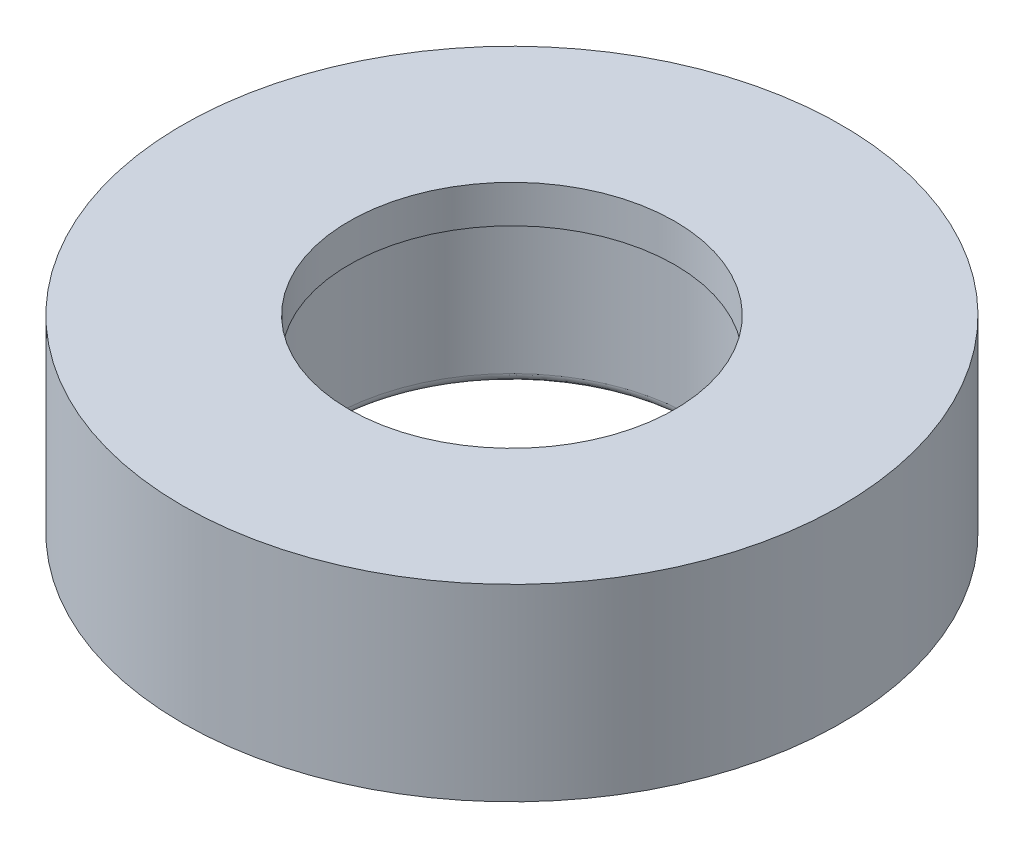
ISO-10303-21;
HEADER;
FILE_DESCRIPTION(('STEP AP214'),'2;1');
FILE_NAME('part.step','',(''),(''),'','','');
FILE_SCHEMA(('AUTOMOTIVE_DESIGN { 1 0 10303 214 1 1 1 1 }'));
ENDSEC;
DATA;
#1=APPLICATION_CONTEXT('core data for automotive mechanical design processes');
#2=APPLICATION_PROTOCOL_DEFINITION('international standard','automotive_design',2000,#1);
#3=PRODUCT_CONTEXT('',#1,'mechanical');
#4=PRODUCT('Part','Part','',(#3));
#5=PRODUCT_RELATED_PRODUCT_CATEGORY('part','',(#4));
#6=PRODUCT_DEFINITION_FORMATION('','',#4);
#7=PRODUCT_DEFINITION_CONTEXT('part definition',#1,'design');
#8=PRODUCT_DEFINITION('design','',#6,#7);
#9=PRODUCT_DEFINITION_SHAPE('','',#8);
#10=(LENGTH_UNIT() NAMED_UNIT(*) SI_UNIT(.MILLI.,.METRE.));
#11=(NAMED_UNIT(*) PLANE_ANGLE_UNIT() SI_UNIT($,.RADIAN.));
#12=(NAMED_UNIT(*) SI_UNIT($,.STERADIAN.) SOLID_ANGLE_UNIT());
#13=UNCERTAINTY_MEASURE_WITH_UNIT(LENGTH_MEASURE(1.E-05),#10,'distance_accuracy_value','');
#14=(GEOMETRIC_REPRESENTATION_CONTEXT(3) GLOBAL_UNCERTAINTY_ASSIGNED_CONTEXT((#13)) GLOBAL_UNIT_ASSIGNED_CONTEXT((#10,
#11,#12)) REPRESENTATION_CONTEXT('',''));
#15=CARTESIAN_POINT('',(0.,0.,0.));
#16=DIRECTION('',(0.,0.,1.));
#17=DIRECTION('',(1.,0.,0.));
#18=AXIS2_PLACEMENT_3D('',#15,#16,#17);
#19=CARTESIAN_POINT('',(0.,0.5,0.));
#20=DIRECTION('',(0.,1.,0.));
#21=DIRECTION('',(0.,0.,1.));
#22=AXIS2_PLACEMENT_3D('',#19,#20,#21);
#23=TOROIDAL_SURFACE('',#22,10.15,0.5);
#24=CARTESIAN_POINT('',(0.,0.,0.));
#25=DIRECTION('',(0.,1.,0.));
#26=DIRECTION('',(0.,0.,1.));
#27=AXIS2_PLACEMENT_3D('',#24,#25,#26);
#28=CIRCLE('',#27,10.15);
#29=CARTESIAN_POINT('',(0.,0.,10.15));
#30=VERTEX_POINT('',#29);
#31=EDGE_CURVE('E39',#30,#30,#28,.T.);
#32=ORIENTED_EDGE('',*,*,#31,.F.);
#33=EDGE_LOOP('',(#32));
#34=FACE_BOUND('',#33,.T.);
#35=CARTESIAN_POINT('',(0.,0.5,0.));
#36=DIRECTION('',(0.,1.,0.));
#37=DIRECTION('',(0.,0.,1.));
#38=AXIS2_PLACEMENT_3D('',#35,#36,#37);
#39=CIRCLE('',#38,9.65);
#40=CARTESIAN_POINT('',(0.,0.5,9.65));
#41=VERTEX_POINT('',#40);
#42=EDGE_CURVE('E10',#41,#41,#39,.F.);
#43=ORIENTED_EDGE('',*,*,#42,.F.);
#44=EDGE_LOOP('',(#43));
#45=FACE_BOUND('',#44,.T.);
#46=ADVANCED_FACE('F33',(#34,#45),#23,.T.);
#47=CARTESIAN_POINT('',(0.,10.,0.));
#48=DIRECTION('',(0.,-1.,0.));
#49=DIRECTION('',(0.,0.,-1.));
#50=AXIS2_PLACEMENT_3D('',#47,#48,#49);
#51=CYLINDRICAL_SURFACE('',#50,9.65);
#52=ORIENTED_EDGE('',*,*,#42,.T.);
#53=EDGE_LOOP('',(#52));
#54=FACE_BOUND('',#53,.T.);
#55=CARTESIAN_POINT('',(0.,8.,0.));
#56=DIRECTION('',(0.,1.,0.));
#57=DIRECTION('',(0.,0.,1.));
#58=AXIS2_PLACEMENT_3D('',#55,#56,#57);
#59=CIRCLE('',#58,9.65);
#60=CARTESIAN_POINT('',(0.,8.,9.65));
#61=VERTEX_POINT('',#60);
#62=EDGE_CURVE('E51',#61,#61,#59,.T.);
#63=ORIENTED_EDGE('',*,*,#62,.T.);
#64=EDGE_LOOP('',(#63));
#65=FACE_BOUND('',#64,.T.);
#66=ADVANCED_FACE('F74',(#54,#65),#51,.F.);
#67=CARTESIAN_POINT('',(0.,10.,0.));
#68=DIRECTION('',(0.,1.,0.));
#69=DIRECTION('',(0.,0.,1.));
#70=AXIS2_PLACEMENT_3D('',#67,#68,#69);
#71=PLANE('',#70);
#72=CARTESIAN_POINT('',(0.,10.,0.));
#73=DIRECTION('',(0.,1.,0.));
#74=DIRECTION('',(0.,0.,1.));
#75=AXIS2_PLACEMENT_3D('',#72,#73,#74);
#76=CIRCLE('',#75,17.5);
#77=CARTESIAN_POINT('',(0.,10.,17.5));
#78=VERTEX_POINT('',#77);
#79=EDGE_CURVE('E43',#78,#78,#76,.T.);
#80=ORIENTED_EDGE('',*,*,#79,.T.);
#81=EDGE_LOOP('',(#80));
#82=FACE_BOUND('',#81,.T.);
#83=CARTESIAN_POINT('',(0.,10.,0.));
#84=DIRECTION('',(0.,1.,0.));
#85=DIRECTION('',(0.,0.,1.));
#86=AXIS2_PLACEMENT_3D('',#83,#84,#85);
#87=CIRCLE('',#86,8.65);
#88=CARTESIAN_POINT('',(0.,10.,8.65));
#89=VERTEX_POINT('',#88);
#90=EDGE_CURVE('E56',#89,#89,#87,.T.);
#91=ORIENTED_EDGE('',*,*,#90,.F.);
#92=EDGE_LOOP('',(#91));
#93=FACE_BOUND('',#92,.T.);
#94=ADVANCED_FACE('F71',(#82,#93),#71,.T.);
#95=CARTESIAN_POINT('',(0.,0.,0.));
#96=DIRECTION('',(0.,1.,0.));
#97=DIRECTION('',(0.,0.,1.));
#98=AXIS2_PLACEMENT_3D('',#95,#96,#97);
#99=PLANE('',#98);
#100=ORIENTED_EDGE('',*,*,#31,.T.);
#101=EDGE_LOOP('',(#100));
#102=FACE_BOUND('',#101,.T.);
#103=CARTESIAN_POINT('',(0.,0.,0.));
#104=DIRECTION('',(0.,1.,0.));
#105=DIRECTION('',(0.,0.,1.));
#106=AXIS2_PLACEMENT_3D('',#103,#104,#105);
#107=CIRCLE('',#106,17.5);
#108=CARTESIAN_POINT('',(0.,0.,17.5));
#109=VERTEX_POINT('',#108);
#110=EDGE_CURVE('E47',#109,#109,#107,.T.);
#111=ORIENTED_EDGE('',*,*,#110,.F.);
#112=EDGE_LOOP('',(#111));
#113=FACE_BOUND('',#112,.T.);
#114=ADVANCED_FACE('F73',(#102,#113),#99,.F.);
#115=CARTESIAN_POINT('',(0.,10.,0.));
#116=DIRECTION('',(0.,-1.,0.));
#117=DIRECTION('',(0.,0.,-1.));
#118=AXIS2_PLACEMENT_3D('',#115,#116,#117);
#119=CYLINDRICAL_SURFACE('',#118,17.5);
#120=ORIENTED_EDGE('',*,*,#79,.F.);
#121=EDGE_LOOP('',(#120));
#122=FACE_BOUND('',#121,.T.);
#123=ORIENTED_EDGE('',*,*,#110,.T.);
#124=EDGE_LOOP('',(#123));
#125=FACE_BOUND('',#124,.T.);
#126=ADVANCED_FACE('F81',(#122,#125),#119,.T.);
#127=CARTESIAN_POINT('',(0.,8.,0.));
#128=DIRECTION('',(0.,1.,0.));
#129=DIRECTION('',(0.,0.,1.));
#130=AXIS2_PLACEMENT_3D('',#127,#128,#129);
#131=PLANE('',#130);
#132=CARTESIAN_POINT('',(0.,8.,0.));
#133=DIRECTION('',(0.,1.,0.));
#134=DIRECTION('',(0.,0.,1.));
#135=AXIS2_PLACEMENT_3D('',#132,#133,#134);
#136=CIRCLE('',#135,8.65);
#137=CARTESIAN_POINT('',(0.,8.,8.65));
#138=VERTEX_POINT('',#137);
#139=EDGE_CURVE('E55',#138,#138,#136,.T.);
#140=ORIENTED_EDGE('',*,*,#139,.T.);
#141=EDGE_LOOP('',(#140));
#142=FACE_BOUND('',#141,.T.);
#143=ORIENTED_EDGE('',*,*,#62,.F.);
#144=EDGE_LOOP('',(#143));
#145=FACE_BOUND('',#144,.T.);
#146=ADVANCED_FACE('F62',(#142,#145),#131,.F.);
#147=CARTESIAN_POINT('',(0.,8.,0.));
#148=DIRECTION('',(0.,1.,0.));
#149=DIRECTION('',(0.,0.,1.));
#150=AXIS2_PLACEMENT_3D('',#147,#148,#149);
#151=CYLINDRICAL_SURFACE('',#150,8.65);
#152=ORIENTED_EDGE('',*,*,#139,.F.);
#153=EDGE_LOOP('',(#152));
#154=FACE_BOUND('',#153,.T.);
#155=ORIENTED_EDGE('',*,*,#90,.T.);
#156=EDGE_LOOP('',(#155));
#157=FACE_BOUND('',#156,.T.);
#158=ADVANCED_FACE('F65',(#154,#157),#151,.F.);
#159=CLOSED_SHELL('',(#46,#66,#94,#114,#126,#146,#158));
#160=MANIFOLD_SOLID_BREP('B2',#159);
#161=ADVANCED_BREP_SHAPE_REPRESENTATION('',(#18,#160),#14);
#162=SHAPE_DEFINITION_REPRESENTATION(#9,#161);
ENDSEC;
END-ISO-10303-21;
